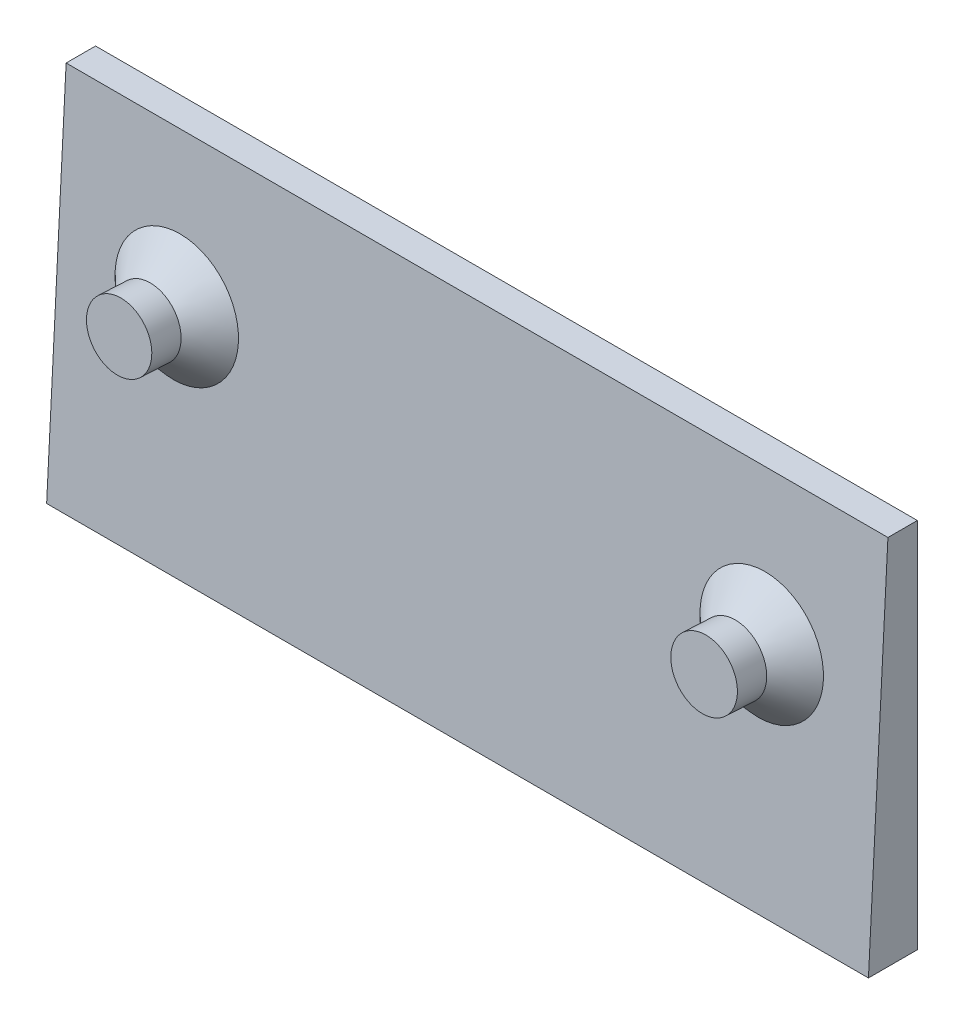
ISO-10303-21;
HEADER;
FILE_DESCRIPTION(('STEP AP214'),'2;1');
FILE_NAME('part.step','',(''),(''),'','','');
FILE_SCHEMA(('AUTOMOTIVE_DESIGN { 1 0 10303 214 1 1 1 1 }'));
ENDSEC;
DATA;
#1=APPLICATION_CONTEXT('core data for automotive mechanical design processes');
#2=APPLICATION_PROTOCOL_DEFINITION('international standard','automotive_design',2000,#1);
#3=PRODUCT_CONTEXT('',#1,'mechanical');
#4=PRODUCT('Part','Part','',(#3));
#5=PRODUCT_RELATED_PRODUCT_CATEGORY('part','',(#4));
#6=PRODUCT_DEFINITION_FORMATION('','',#4);
#7=PRODUCT_DEFINITION_CONTEXT('part definition',#1,'design');
#8=PRODUCT_DEFINITION('design','',#6,#7);
#9=PRODUCT_DEFINITION_SHAPE('','',#8);
#10=(LENGTH_UNIT() NAMED_UNIT(*) SI_UNIT(.MILLI.,.METRE.));
#11=(NAMED_UNIT(*) PLANE_ANGLE_UNIT() SI_UNIT($,.RADIAN.));
#12=(NAMED_UNIT(*) SI_UNIT($,.STERADIAN.) SOLID_ANGLE_UNIT());
#13=UNCERTAINTY_MEASURE_WITH_UNIT(LENGTH_MEASURE(1.E-05),#10,'distance_accuracy_value','');
#14=(GEOMETRIC_REPRESENTATION_CONTEXT(3) GLOBAL_UNCERTAINTY_ASSIGNED_CONTEXT((#13)) GLOBAL_UNIT_ASSIGNED_CONTEXT((#10,
#11,#12)) REPRESENTATION_CONTEXT('',''));
#15=CARTESIAN_POINT('',(0.,0.,0.));
#16=DIRECTION('',(0.,0.,1.));
#17=DIRECTION('',(1.,0.,0.));
#18=AXIS2_PLACEMENT_3D('',#15,#16,#17);
#19=CARTESIAN_POINT('',(42.,-19.,5.));
#20=DIRECTION('',(-1.,0.,0.));
#21=DIRECTION('',(0.,0.,1.));
#22=AXIS2_PLACEMENT_3D('',#19,#20,#21);
#23=PLANE('',#22);
#24=DIRECTION('',(0.,0.,-1.));
#25=VECTOR('',#24,1.);
#26=CARTESIAN_POINT('',(42.,19.,5.));
#27=LINE('',#26,#25);
#28=CARTESIAN_POINT('',(42.,19.,3.00850438724443));
#29=VERTEX_POINT('',#28);
#30=CARTESIAN_POINT('',(42.,19.,0.));
#31=VERTEX_POINT('',#30);
#32=EDGE_CURVE('E12',#29,#31,#27,.T.);
#33=ORIENTED_EDGE('',*,*,#32,.F.);
#34=DIRECTION('',(0.,0.998629534754574,-0.0523359562429439));
#35=VECTOR('',#34,1.);
#36=CARTESIAN_POINT('',(42.,-19.,5.));
#37=LINE('',#36,#35);
#38=CARTESIAN_POINT('',(42.,-19.,5.));
#39=VERTEX_POINT('',#38);
#40=EDGE_CURVE('E167',#39,#29,#37,.T.);
#41=ORIENTED_EDGE('',*,*,#40,.F.);
#42=DIRECTION('',(0.,0.,-1.));
#43=VECTOR('',#42,1.);
#44=CARTESIAN_POINT('',(42.,-19.,5.));
#45=LINE('',#44,#43);
#46=CARTESIAN_POINT('',(42.,-19.,0.));
#47=VERTEX_POINT('',#46);
#48=EDGE_CURVE('E95',#39,#47,#45,.T.);
#49=ORIENTED_EDGE('',*,*,#48,.T.);
#50=DIRECTION('',(0.,1.,0.));
#51=VECTOR('',#50,1.);
#52=CARTESIAN_POINT('',(42.,-19.,0.));
#53=LINE('',#52,#51);
#54=EDGE_CURVE('E100',#47,#31,#53,.T.);
#55=ORIENTED_EDGE('',*,*,#54,.T.);
#56=EDGE_LOOP('',(#33,#41,#49,#55));
#57=FACE_BOUND('',#56,.T.);
#58=ADVANCED_FACE('F43',(#57),#23,.F.);
#59=CARTESIAN_POINT('',(-42.,19.,5.));
#60=DIRECTION('',(0.,-1.,0.));
#61=DIRECTION('',(0.,0.,-1.));
#62=AXIS2_PLACEMENT_3D('',#59,#60,#61);
#63=PLANE('',#62);
#64=DIRECTION('',(0.,0.,-1.));
#65=VECTOR('',#64,1.);
#66=CARTESIAN_POINT('',(-42.,19.,5.));
#67=LINE('',#66,#65);
#68=CARTESIAN_POINT('',(-42.,19.,3.00850438724443));
#69=VERTEX_POINT('',#68);
#70=CARTESIAN_POINT('',(-42.,19.,0.));
#71=VERTEX_POINT('',#70);
#72=EDGE_CURVE('E54',#69,#71,#67,.T.);
#73=ORIENTED_EDGE('',*,*,#72,.F.);
#74=DIRECTION('',(1.,0.,0.));
#75=VECTOR('',#74,1.);
#76=CARTESIAN_POINT('',(-42.,19.,3.00850438724443));
#77=LINE('',#76,#75);
#78=EDGE_CURVE('E170',#69,#29,#77,.T.);
#79=ORIENTED_EDGE('',*,*,#78,.T.);
#80=ORIENTED_EDGE('',*,*,#32,.T.);
#81=DIRECTION('',(-1.,0.,0.));
#82=VECTOR('',#81,1.);
#83=CARTESIAN_POINT('',(-42.,19.,0.));
#84=LINE('',#83,#82);
#85=EDGE_CURVE('E88',#31,#71,#84,.T.);
#86=ORIENTED_EDGE('',*,*,#85,.T.);
#87=EDGE_LOOP('',(#73,#79,#80,#86));
#88=FACE_BOUND('',#87,.T.);
#89=ADVANCED_FACE('F174',(#88),#63,.F.);
#90=CARTESIAN_POINT('',(-42.,-19.,5.));
#91=DIRECTION('',(1.,0.,0.));
#92=DIRECTION('',(0.,0.,-1.));
#93=AXIS2_PLACEMENT_3D('',#90,#91,#92);
#94=PLANE('',#93);
#95=DIRECTION('',(0.,0.,-1.));
#96=VECTOR('',#95,1.);
#97=CARTESIAN_POINT('',(-42.,-19.,5.));
#98=LINE('',#97,#96);
#99=CARTESIAN_POINT('',(-42.,-19.,5.));
#100=VERTEX_POINT('',#99);
#101=CARTESIAN_POINT('',(-42.,-19.,0.));
#102=VERTEX_POINT('',#101);
#103=EDGE_CURVE('E80',#100,#102,#98,.T.);
#104=ORIENTED_EDGE('',*,*,#103,.F.);
#105=DIRECTION('',(0.,-0.998629534754574,0.0523359562429439));
#106=VECTOR('',#105,1.);
#107=CARTESIAN_POINT('',(-42.,-19.,5.));
#108=LINE('',#107,#106);
#109=EDGE_CURVE('E62',#69,#100,#108,.T.);
#110=ORIENTED_EDGE('',*,*,#109,.F.);
#111=ORIENTED_EDGE('',*,*,#72,.T.);
#112=DIRECTION('',(0.,-1.,0.));
#113=VECTOR('',#112,1.);
#114=CARTESIAN_POINT('',(-42.,-19.,0.));
#115=LINE('',#114,#113);
#116=EDGE_CURVE('E77',#71,#102,#115,.T.);
#117=ORIENTED_EDGE('',*,*,#116,.T.);
#118=EDGE_LOOP('',(#104,#110,#111,#117));
#119=FACE_BOUND('',#118,.T.);
#120=ADVANCED_FACE('F79',(#119),#94,.F.);
#121=CARTESIAN_POINT('',(-42.,-19.,5.));
#122=DIRECTION('',(0.,1.,0.));
#123=DIRECTION('',(0.,0.,1.));
#124=AXIS2_PLACEMENT_3D('',#121,#122,#123);
#125=PLANE('',#124);
#126=DIRECTION('',(1.,0.,0.));
#127=VECTOR('',#126,1.);
#128=CARTESIAN_POINT('',(-42.,-19.,0.));
#129=LINE('',#128,#127);
#130=EDGE_CURVE('E87',#102,#47,#129,.T.);
#131=ORIENTED_EDGE('',*,*,#130,.T.);
#132=ORIENTED_EDGE('',*,*,#48,.F.);
#133=DIRECTION('',(1.,0.,0.));
#134=VECTOR('',#133,1.);
#135=CARTESIAN_POINT('',(-42.,-19.,5.));
#136=LINE('',#135,#134);
#137=EDGE_CURVE('E94',#100,#39,#136,.T.);
#138=ORIENTED_EDGE('',*,*,#137,.F.);
#139=ORIENTED_EDGE('',*,*,#103,.T.);
#140=EDGE_LOOP('',(#131,#132,#138,#139));
#141=FACE_BOUND('',#140,.T.);
#142=ADVANCED_FACE('F91',(#141),#125,.F.);
#143=CARTESIAN_POINT('',(0.,0.,0.));
#144=DIRECTION('',(0.,0.,-1.));
#145=DIRECTION('',(-1.,0.,0.));
#146=AXIS2_PLACEMENT_3D('',#143,#144,#145);
#147=PLANE('',#146);
#148=ORIENTED_EDGE('',*,*,#54,.F.);
#149=ORIENTED_EDGE('',*,*,#130,.F.);
#150=ORIENTED_EDGE('',*,*,#116,.F.);
#151=ORIENTED_EDGE('',*,*,#85,.F.);
#152=EDGE_LOOP('',(#148,#149,#150,#151));
#153=FACE_BOUND('',#152,.T.);
#154=ADVANCED_FACE('F98',(#153),#147,.T.);
#155=CARTESIAN_POINT('',(0.,-0.0260388396630972,4.00561683138406));
#156=DIRECTION('',(0.,-0.0523359562429439,-0.998629534754574));
#157=DIRECTION('',(-1.,0.,0.));
#158=AXIS2_PLACEMENT_3D('',#155,#156,#157);
#159=PLANE('',#158);
#160=CARTESIAN_POINT('',(29.8956518577535,3.86861634588004,3.80150660203657));
#161=DIRECTION('',(0.,0.052335956242944,0.998629534754574));
#162=DIRECTION('',(0.,-0.998629534754574,0.052335956242944));
#163=AXIS2_PLACEMENT_3D('',#160,#161,#162);
#164=CIRCLE('',#163,6.3);
#165=CARTESIAN_POINT('',(29.8956518577535,-2.42274972307378,4.13122312636712));
#166=VERTEX_POINT('',#165);
#167=EDGE_CURVE('E142',#166,#166,#164,.T.);
#168=ORIENTED_EDGE('',*,*,#167,.F.);
#169=EDGE_LOOP('',(#168));
#170=FACE_BOUND('',#169,.T.);
#171=CARTESIAN_POINT('',(-29.8956518577535,3.86861634588004,3.80150660203657));
#172=DIRECTION('',(0.,0.052335956242944,0.998629534754574));
#173=DIRECTION('',(0.,-0.998629534754574,0.052335956242944));
#174=AXIS2_PLACEMENT_3D('',#171,#172,#173);
#175=CIRCLE('',#174,6.3);
#176=CARTESIAN_POINT('',(-29.8956518577535,-2.42274972307377,4.13122312636712));
#177=VERTEX_POINT('',#176);
#178=EDGE_CURVE('E150',#177,#177,#175,.T.);
#179=ORIENTED_EDGE('',*,*,#178,.F.);
#180=EDGE_LOOP('',(#179));
#181=FACE_BOUND('',#180,.T.);
#182=ORIENTED_EDGE('',*,*,#109,.T.);
#183=ORIENTED_EDGE('',*,*,#137,.T.);
#184=ORIENTED_EDGE('',*,*,#40,.T.);
#185=ORIENTED_EDGE('',*,*,#78,.F.);
#186=EDGE_LOOP('',(#182,#183,#184,#185));
#187=FACE_BOUND('',#186,.T.);
#188=ADVANCED_FACE('F181',(#170,#181,#187),#159,.F.);
#189=CARTESIAN_POINT('',(-29.8956518577535,4.02039061898457,6.69753225282465));
#190=DIRECTION('',(0.,-0.052335956242944,-0.998629534754574));
#191=DIRECTION('',(0.,0.998629534754574,-0.052335956242944));
#192=AXIS2_PLACEMENT_3D('',#189,#190,#191);
#193=CONICAL_SURFACE('',#192,3.33516451704792,0.796452666479386);
#194=ORIENTED_EDGE('',*,*,#178,.T.);
#195=EDGE_LOOP('',(#194));
#196=FACE_BOUND('',#195,.T.);
#197=CARTESIAN_POINT('',(-29.8956518577535,4.02039061898457,6.69753225282465));
#198=DIRECTION('',(0.,-0.052335956242944,-0.998629534754574));
#199=DIRECTION('',(0.,0.998629534754574,-0.052335956242944));
#200=AXIS2_PLACEMENT_3D('',#197,#198,#199);
#201=CIRCLE('',#200,3.33516451704792);
#202=CARTESIAN_POINT('',(-29.8956518577535,7.3509844089741,6.52298322859741));
#203=VERTEX_POINT('',#202);
#204=EDGE_CURVE('E155',#203,#203,#201,.T.);
#205=ORIENTED_EDGE('',*,*,#204,.T.);
#206=EDGE_LOOP('',(#205));
#207=FACE_BOUND('',#206,.T.);
#208=ADVANCED_FACE('F132',(#196,#207),#193,.T.);
#209=CARTESIAN_POINT('',(29.8956518577535,4.02039061898457,6.69753225282465));
#210=DIRECTION('',(0.,-0.052335956242944,-0.998629534754574));
#211=DIRECTION('',(0.,0.998629534754574,-0.052335956242944));
#212=AXIS2_PLACEMENT_3D('',#209,#210,#211);
#213=CONICAL_SURFACE('',#212,3.4,0.78539816339748);
#214=ORIENTED_EDGE('',*,*,#167,.T.);
#215=EDGE_LOOP('',(#214));
#216=FACE_BOUND('',#215,.T.);
#217=CARTESIAN_POINT('',(29.8956518577535,4.02039061898457,6.69753225282465));
#218=DIRECTION('',(0.,-0.052335956242944,-0.998629534754574));
#219=DIRECTION('',(0.,0.998629534754574,-0.0523359562429439));
#220=AXIS2_PLACEMENT_3D('',#217,#218,#219);
#221=CIRCLE('',#220,3.4);
#222=CARTESIAN_POINT('',(29.8956518577535,7.41573103715012,6.51959000159864));
#223=VERTEX_POINT('',#222);
#224=EDGE_CURVE('E111',#223,#223,#221,.T.);
#225=ORIENTED_EDGE('',*,*,#224,.T.);
#226=EDGE_LOOP('',(#225));
#227=FACE_BOUND('',#226,.T.);
#228=ADVANCED_FACE('F127',(#216,#227),#213,.T.);
#229=CARTESIAN_POINT('',(29.8956518577535,4.17739848771299,9.6934208570884));
#230=DIRECTION('',(0.,-0.052335956242944,-0.998629534754574));
#231=DIRECTION('',(0.,0.998629534754574,-0.052335956242944));
#232=AXIS2_PLACEMENT_3D('',#229,#230,#231);
#233=CYLINDRICAL_SURFACE('',#232,3.4);
#234=CARTESIAN_POINT('',(29.8956518577535,4.17739848771299,9.6934208570884));
#235=DIRECTION('',(0.,-0.052335956242944,-0.998629534754574));
#236=DIRECTION('',(0.,0.998629534754574,-0.052335956242944));
#237=AXIS2_PLACEMENT_3D('',#234,#235,#236);
#238=CIRCLE('',#237,3.4);
#239=CARTESIAN_POINT('',(29.8956518577535,7.57273890587854,9.51547860586239));
#240=VERTEX_POINT('',#239);
#241=EDGE_CURVE('E280',#240,#240,#238,.T.);
#242=ORIENTED_EDGE('',*,*,#241,.T.);
#243=EDGE_LOOP('',(#242));
#244=FACE_BOUND('',#243,.T.);
#245=ORIENTED_EDGE('',*,*,#224,.F.);
#246=EDGE_LOOP('',(#245));
#247=FACE_BOUND('',#246,.T.);
#248=ADVANCED_FACE('F116',(#244,#247),#233,.T.);
#249=CARTESIAN_POINT('',(29.8956518577535,4.17739848771299,9.6934208570884));
#250=DIRECTION('',(0.,-0.052335956242944,-0.998629534754574));
#251=DIRECTION('',(0.,0.998629534754574,-0.052335956242944));
#252=AXIS2_PLACEMENT_3D('',#249,#250,#251);
#253=PLANE('',#252);
#254=ORIENTED_EDGE('',*,*,#241,.F.);
#255=EDGE_LOOP('',(#254));
#256=FACE_BOUND('',#255,.T.);
#257=ADVANCED_FACE('F126',(#256),#253,.F.);
#258=CARTESIAN_POINT('',(-29.8956518577535,4.17739848771299,9.6934208570884));
#259=DIRECTION('',(0.,-0.052335956242944,-0.998629534754574));
#260=DIRECTION('',(0.,0.998629534754574,-0.052335956242944));
#261=AXIS2_PLACEMENT_3D('',#258,#259,#260);
#262=CYLINDRICAL_SURFACE('',#261,3.33516451704792);
#263=CARTESIAN_POINT('',(-29.8956518577535,4.17739848771299,9.6934208570884));
#264=DIRECTION('',(0.,-0.052335956242944,-0.998629534754574));
#265=DIRECTION('',(0.,0.998629534754574,-0.052335956242944));
#266=AXIS2_PLACEMENT_3D('',#263,#264,#265);
#267=CIRCLE('',#266,3.33516451704792);
#268=CARTESIAN_POINT('',(-29.8956518577535,7.50799227770252,9.51887183286116));
#269=VERTEX_POINT('',#268);
#270=EDGE_CURVE('E151',#269,#269,#267,.T.);
#271=ORIENTED_EDGE('',*,*,#270,.T.);
#272=EDGE_LOOP('',(#271));
#273=FACE_BOUND('',#272,.T.);
#274=ORIENTED_EDGE('',*,*,#204,.F.);
#275=EDGE_LOOP('',(#274));
#276=FACE_BOUND('',#275,.T.);
#277=ADVANCED_FACE('F251',(#273,#276),#262,.T.);
#278=CARTESIAN_POINT('',(-29.8956518577535,4.17739848771299,9.6934208570884));
#279=DIRECTION('',(0.,-0.052335956242944,-0.998629534754574));
#280=DIRECTION('',(0.,0.998629534754574,-0.052335956242944));
#281=AXIS2_PLACEMENT_3D('',#278,#279,#280);
#282=PLANE('',#281);
#283=ORIENTED_EDGE('',*,*,#270,.F.);
#284=EDGE_LOOP('',(#283));
#285=FACE_BOUND('',#284,.T.);
#286=ADVANCED_FACE('F259',(#285),#282,.F.);
#287=CLOSED_SHELL('',(#58,#89,#120,#142,#154,#188,#208,#228,#248,#257,#277,#286));
#288=MANIFOLD_SOLID_BREP('B2',#287);
#289=ADVANCED_BREP_SHAPE_REPRESENTATION('',(#18,#288),#14);
#290=SHAPE_DEFINITION_REPRESENTATION(#9,#289);
ENDSEC;
END-ISO-10303-21;
